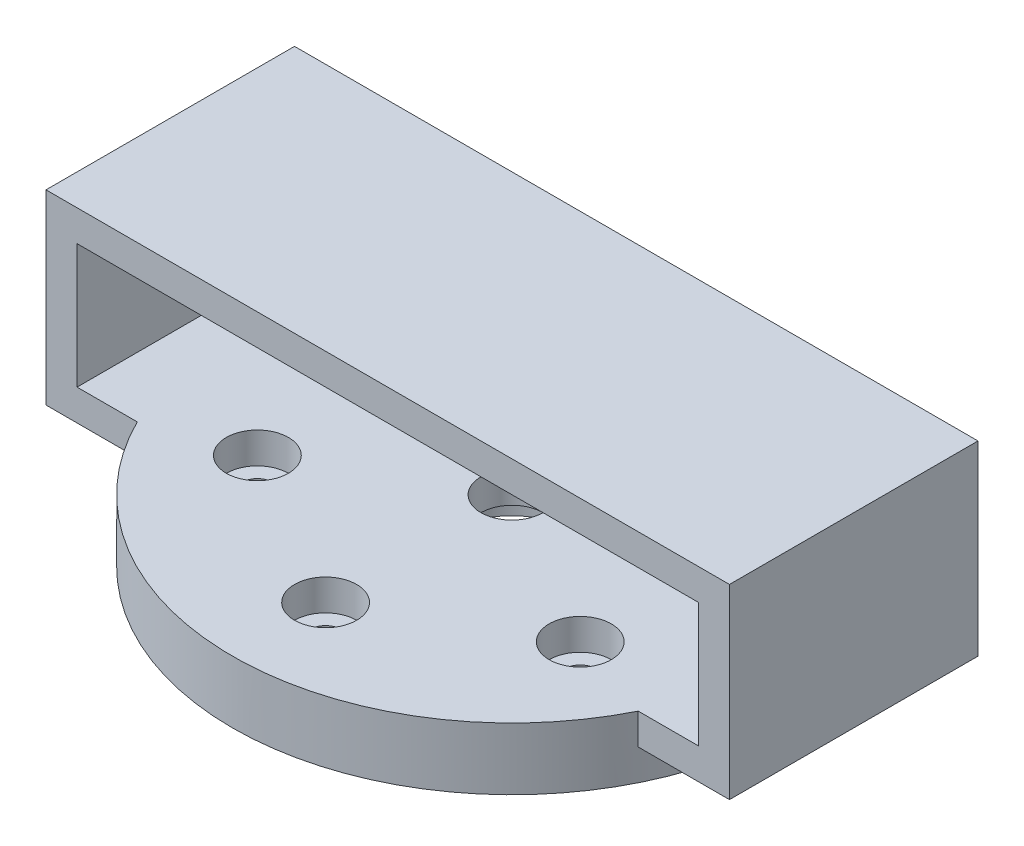
ISO-10303-21;
HEADER;
FILE_DESCRIPTION(('STEP AP214'),'2;1');
FILE_NAME('part.step','',(''),(''),'','','');
FILE_SCHEMA(('AUTOMOTIVE_DESIGN { 1 0 10303 214 1 1 1 1 }'));
ENDSEC;
DATA;
#1=APPLICATION_CONTEXT('core data for automotive mechanical design processes');
#2=APPLICATION_PROTOCOL_DEFINITION('international standard','automotive_design',2000,#1);
#3=PRODUCT_CONTEXT('',#1,'mechanical');
#4=PRODUCT('Part','Part','',(#3));
#5=PRODUCT_RELATED_PRODUCT_CATEGORY('part','',(#4));
#6=PRODUCT_DEFINITION_FORMATION('','',#4);
#7=PRODUCT_DEFINITION_CONTEXT('part definition',#1,'design');
#8=PRODUCT_DEFINITION('design','',#6,#7);
#9=PRODUCT_DEFINITION_SHAPE('','',#8);
#10=(LENGTH_UNIT() NAMED_UNIT(*) SI_UNIT(.MILLI.,.METRE.));
#11=(NAMED_UNIT(*) PLANE_ANGLE_UNIT() SI_UNIT($,.RADIAN.));
#12=(NAMED_UNIT(*) SI_UNIT($,.STERADIAN.) SOLID_ANGLE_UNIT());
#13=UNCERTAINTY_MEASURE_WITH_UNIT(LENGTH_MEASURE(1.E-05),#10,'distance_accuracy_value','');
#14=(GEOMETRIC_REPRESENTATION_CONTEXT(3) GLOBAL_UNCERTAINTY_ASSIGNED_CONTEXT((#13)) GLOBAL_UNIT_ASSIGNED_CONTEXT((#10,
#11,#12)) REPRESENTATION_CONTEXT('',''));
#15=CARTESIAN_POINT('',(0.,0.,0.));
#16=DIRECTION('',(0.,0.,1.));
#17=DIRECTION('',(1.,0.,0.));
#18=AXIS2_PLACEMENT_3D('',#15,#16,#17);
#19=CARTESIAN_POINT('',(0.,10.,-30.));
#20=DIRECTION('',(0.,-1.,0.));
#21=DIRECTION('',(0.,0.,-1.));
#22=AXIS2_PLACEMENT_3D('',#19,#20,#21);
#23=CYLINDRICAL_SURFACE('',#22,2.5);
#24=CARTESIAN_POINT('',(0.,0.,-30.));
#25=DIRECTION('',(0.,1.,0.));
#26=DIRECTION('',(0.,0.,1.));
#27=AXIS2_PLACEMENT_3D('',#24,#25,#26);
#28=CIRCLE('',#27,2.5);
#29=CARTESIAN_POINT('',(0.,0.,-27.5));
#30=VERTEX_POINT('',#29);
#31=EDGE_CURVE('E225',#30,#30,#28,.T.);
#32=ORIENTED_EDGE('',*,*,#31,.F.);
#33=EDGE_LOOP('',(#32));
#34=FACE_BOUND('',#33,.T.);
#35=CARTESIAN_POINT('',(0.,5.,-30.));
#36=DIRECTION('',(0.,1.,0.));
#37=DIRECTION('',(0.,0.,1.));
#38=AXIS2_PLACEMENT_3D('',#35,#36,#37);
#39=CIRCLE('',#38,2.5);
#40=CARTESIAN_POINT('',(0.,5.,-27.5));
#41=VERTEX_POINT('',#40);
#42=EDGE_CURVE('E39',#41,#41,#39,.T.);
#43=ORIENTED_EDGE('',*,*,#42,.T.);
#44=EDGE_LOOP('',(#43));
#45=FACE_BOUND('',#44,.T.);
#46=ADVANCED_FACE('F35',(#34,#45),#23,.F.);
#47=CARTESIAN_POINT('',(3.39958331045615E-12,10.,30.));
#48=DIRECTION('',(0.,-1.,0.));
#49=DIRECTION('',(0.,0.,-1.));
#50=AXIS2_PLACEMENT_3D('',#47,#48,#49);
#51=CYLINDRICAL_SURFACE('',#50,2.50000000000345);
#52=CARTESIAN_POINT('',(3.39958331045615E-12,0.,30.));
#53=DIRECTION('',(0.,1.,0.));
#54=DIRECTION('',(0.,0.,1.));
#55=AXIS2_PLACEMENT_3D('',#52,#53,#54);
#56=CIRCLE('',#55,2.50000000000345);
#57=CARTESIAN_POINT('',(3.39958331045615E-12,0.,32.5000000000035));
#58=VERTEX_POINT('',#57);
#59=EDGE_CURVE('E216',#58,#58,#56,.T.);
#60=ORIENTED_EDGE('',*,*,#59,.F.);
#61=EDGE_LOOP('',(#60));
#62=FACE_BOUND('',#61,.T.);
#63=CARTESIAN_POINT('',(3.39958331045615E-12,5.,30.));
#64=DIRECTION('',(0.,1.,0.));
#65=DIRECTION('',(0.,0.,1.));
#66=AXIS2_PLACEMENT_3D('',#63,#64,#65);
#67=CIRCLE('',#66,2.50000000000345);
#68=CARTESIAN_POINT('',(3.39958331045615E-12,5.,32.5000000000035));
#69=VERTEX_POINT('',#68);
#70=EDGE_CURVE('E251',#69,#69,#67,.T.);
#71=ORIENTED_EDGE('',*,*,#70,.T.);
#72=EDGE_LOOP('',(#71));
#73=FACE_BOUND('',#72,.T.);
#74=ADVANCED_FACE('F320',(#62,#73),#51,.F.);
#75=CARTESIAN_POINT('',(0.,10.,0.));
#76=DIRECTION('',(0.,-1.,0.));
#77=DIRECTION('',(0.,0.,-1.));
#78=AXIS2_PLACEMENT_3D('',#75,#76,#77);
#79=CYLINDRICAL_SURFACE('',#78,10.);
#80=CARTESIAN_POINT('',(0.,0.,0.));
#81=DIRECTION('',(0.,1.,0.));
#82=DIRECTION('',(0.,0.,1.));
#83=AXIS2_PLACEMENT_3D('',#80,#81,#82);
#84=CIRCLE('',#83,10.);
#85=CARTESIAN_POINT('',(0.,0.,10.));
#86=VERTEX_POINT('',#85);
#87=EDGE_CURVE('E228',#86,#86,#84,.T.);
#88=ORIENTED_EDGE('',*,*,#87,.F.);
#89=EDGE_LOOP('',(#88));
#90=FACE_BOUND('',#89,.T.);
#91=CARTESIAN_POINT('',(0.,5.,0.));
#92=DIRECTION('',(0.,1.,0.));
#93=DIRECTION('',(0.,0.,1.));
#94=AXIS2_PLACEMENT_3D('',#91,#92,#93);
#95=CIRCLE('',#94,10.);
#96=CARTESIAN_POINT('',(0.,5.,10.));
#97=VERTEX_POINT('',#96);
#98=EDGE_CURVE('E190',#97,#97,#95,.T.);
#99=ORIENTED_EDGE('',*,*,#98,.T.);
#100=EDGE_LOOP('',(#99));
#101=FACE_BOUND('',#100,.T.);
#102=ADVANCED_FACE('F326',(#90,#101),#79,.F.);
#103=CARTESIAN_POINT('',(25.980762113534,10.,-15.0000000000015));
#104=DIRECTION('',(0.,-1.,0.));
#105=DIRECTION('',(0.,0.,-1.));
#106=AXIS2_PLACEMENT_3D('',#103,#104,#105);
#107=CYLINDRICAL_SURFACE('',#106,2.50000000000046);
#108=CARTESIAN_POINT('',(25.980762113534,0.,-15.0000000000015));
#109=DIRECTION('',(0.,1.,0.));
#110=DIRECTION('',(0.,0.,1.));
#111=AXIS2_PLACEMENT_3D('',#108,#109,#110);
#112=CIRCLE('',#111,2.50000000000046);
#113=CARTESIAN_POINT('',(25.980762113534,0.,-12.500000000001));
#114=VERTEX_POINT('',#113);
#115=EDGE_CURVE('E222',#114,#114,#112,.T.);
#116=ORIENTED_EDGE('',*,*,#115,.F.);
#117=EDGE_LOOP('',(#116));
#118=FACE_BOUND('',#117,.T.);
#119=CARTESIAN_POINT('',(25.980762113534,5.,-15.0000000000015));
#120=DIRECTION('',(0.,1.,0.));
#121=DIRECTION('',(0.,0.,1.));
#122=AXIS2_PLACEMENT_3D('',#119,#120,#121);
#123=CIRCLE('',#122,2.50000000000046);
#124=CARTESIAN_POINT('',(25.980762113534,5.,-12.500000000001));
#125=VERTEX_POINT('',#124);
#126=EDGE_CURVE('E202',#125,#125,#123,.T.);
#127=ORIENTED_EDGE('',*,*,#126,.T.);
#128=EDGE_LOOP('',(#127));
#129=FACE_BOUND('',#128,.T.);
#130=ADVANCED_FACE('F332',(#118,#129),#107,.F.);
#131=CARTESIAN_POINT('',(25.9807621135357,10.,14.9999999999985));
#132=DIRECTION('',(0.,-1.,0.));
#133=DIRECTION('',(0.,0.,-1.));
#134=AXIS2_PLACEMENT_3D('',#131,#132,#133);
#135=CYLINDRICAL_SURFACE('',#134,2.50000000000215);
#136=CARTESIAN_POINT('',(25.9807621135357,0.,14.9999999999985));
#137=DIRECTION('',(0.,1.,0.));
#138=DIRECTION('',(0.,0.,1.));
#139=AXIS2_PLACEMENT_3D('',#136,#137,#138);
#140=CIRCLE('',#139,2.50000000000215);
#141=CARTESIAN_POINT('',(25.9807621135357,0.,17.5000000000007));
#142=VERTEX_POINT('',#141);
#143=EDGE_CURVE('E219',#142,#142,#140,.T.);
#144=ORIENTED_EDGE('',*,*,#143,.F.);
#145=EDGE_LOOP('',(#144));
#146=FACE_BOUND('',#145,.T.);
#147=CARTESIAN_POINT('',(25.9807621135357,5.,14.9999999999985));
#148=DIRECTION('',(0.,1.,0.));
#149=DIRECTION('',(0.,0.,1.));
#150=AXIS2_PLACEMENT_3D('',#147,#148,#149);
#151=CIRCLE('',#150,2.50000000000215);
#152=CARTESIAN_POINT('',(25.9807621135357,5.,17.5000000000007));
#153=VERTEX_POINT('',#152);
#154=EDGE_CURVE('E199',#153,#153,#151,.T.);
#155=ORIENTED_EDGE('',*,*,#154,.T.);
#156=EDGE_LOOP('',(#155));
#157=FACE_BOUND('',#156,.T.);
#158=ADVANCED_FACE('F339',(#146,#157),#135,.F.);
#159=CARTESIAN_POINT('',(-25.9807621135306,10.,15.0000000000015));
#160=DIRECTION('',(0.,-1.,0.));
#161=DIRECTION('',(0.,0.,-1.));
#162=AXIS2_PLACEMENT_3D('',#159,#160,#161);
#163=CYLINDRICAL_SURFACE('',#162,2.50000000000315);
#164=CARTESIAN_POINT('',(-25.9807621135306,0.,15.0000000000015));
#165=DIRECTION('',(0.,1.,0.));
#166=DIRECTION('',(0.,0.,1.));
#167=AXIS2_PLACEMENT_3D('',#164,#165,#166);
#168=CIRCLE('',#167,2.50000000000315);
#169=CARTESIAN_POINT('',(-25.9807621135306,0.,17.5000000000046));
#170=VERTEX_POINT('',#169);
#171=EDGE_CURVE('E213',#170,#170,#168,.T.);
#172=ORIENTED_EDGE('',*,*,#171,.F.);
#173=EDGE_LOOP('',(#172));
#174=FACE_BOUND('',#173,.T.);
#175=CARTESIAN_POINT('',(-25.9807621135306,5.,15.0000000000015));
#176=DIRECTION('',(0.,1.,0.));
#177=DIRECTION('',(0.,0.,1.));
#178=AXIS2_PLACEMENT_3D('',#175,#176,#177);
#179=CIRCLE('',#178,2.50000000000315);
#180=CARTESIAN_POINT('',(-25.9807621135306,5.,17.5000000000046));
#181=VERTEX_POINT('',#180);
#182=EDGE_CURVE('E196',#181,#181,#179,.T.);
#183=ORIENTED_EDGE('',*,*,#182,.T.);
#184=EDGE_LOOP('',(#183));
#185=FACE_BOUND('',#184,.T.);
#186=ADVANCED_FACE('F313',(#174,#185),#163,.F.);
#187=CARTESIAN_POINT('',(-25.9807621135323,10.,-14.9999999999985));
#188=DIRECTION('',(0.,-1.,0.));
#189=DIRECTION('',(0.,0.,-1.));
#190=AXIS2_PLACEMENT_3D('',#187,#188,#189);
#191=CYLINDRICAL_SURFACE('',#190,2.5000000000016);
#192=CARTESIAN_POINT('',(-25.9807621135323,0.,-14.9999999999985));
#193=DIRECTION('',(0.,1.,0.));
#194=DIRECTION('',(0.,0.,1.));
#195=AXIS2_PLACEMENT_3D('',#192,#193,#194);
#196=CIRCLE('',#195,2.5000000000016);
#197=CARTESIAN_POINT('',(-25.9807621135323,0.,-12.4999999999969));
#198=VERTEX_POINT('',#197);
#199=EDGE_CURVE('E210',#198,#198,#196,.T.);
#200=ORIENTED_EDGE('',*,*,#199,.F.);
#201=EDGE_LOOP('',(#200));
#202=FACE_BOUND('',#201,.T.);
#203=CARTESIAN_POINT('',(-25.9807621135323,5.,-14.9999999999985));
#204=DIRECTION('',(0.,1.,0.));
#205=DIRECTION('',(0.,0.,1.));
#206=AXIS2_PLACEMENT_3D('',#203,#204,#205);
#207=CIRCLE('',#206,2.5000000000016);
#208=CARTESIAN_POINT('',(-25.9807621135323,5.,-12.4999999999969));
#209=VERTEX_POINT('',#208);
#210=EDGE_CURVE('E146',#209,#209,#207,.T.);
#211=ORIENTED_EDGE('',*,*,#210,.T.);
#212=EDGE_LOOP('',(#211));
#213=FACE_BOUND('',#212,.T.);
#214=ADVANCED_FACE('F305',(#202,#213),#191,.F.);
#215=CARTESIAN_POINT('',(0.,10.,0.));
#216=DIRECTION('',(0.,1.,0.));
#217=DIRECTION('',(0.,0.,1.));
#218=AXIS2_PLACEMENT_3D('',#215,#216,#217);
#219=PLANE('',#218);
#220=CARTESIAN_POINT('',(0.,10.,-30.));
#221=DIRECTION('',(0.,1.,0.));
#222=DIRECTION('',(0.,0.,1.));
#223=AXIS2_PLACEMENT_3D('',#220,#221,#222);
#224=CIRCLE('',#223,5.);
#225=CARTESIAN_POINT('',(0.,10.,-25.));
#226=VERTEX_POINT('',#225);
#227=EDGE_CURVE('E258',#226,#226,#224,.T.);
#228=ORIENTED_EDGE('',*,*,#227,.F.);
#229=EDGE_LOOP('',(#228));
#230=FACE_BOUND('',#229,.T.);
#231=CARTESIAN_POINT('',(1.69794191727524E-12,10.,0.));
#232=DIRECTION('',(0.,1.,0.));
#233=DIRECTION('',(0.,0.,1.));
#234=AXIS2_PLACEMENT_3D('',#231,#232,#233);
#235=CIRCLE('',#234,5.);
#236=CARTESIAN_POINT('',(1.69794191727524E-12,10.,5.));
#237=VERTEX_POINT('',#236);
#238=EDGE_CURVE('E268',#237,#237,#235,.T.);
#239=ORIENTED_EDGE('',*,*,#238,.F.);
#240=EDGE_LOOP('',(#239));
#241=FACE_BOUND('',#240,.T.);
#242=CARTESIAN_POINT('',(25.980762113534,10.,-15.0000000000015));
#243=DIRECTION('',(0.,1.,0.));
#244=DIRECTION('',(0.,0.,1.));
#245=AXIS2_PLACEMENT_3D('',#242,#243,#244);
#246=CIRCLE('',#245,5.00000000000046);
#247=CARTESIAN_POINT('',(25.980762113534,10.,-10.000000000001));
#248=VERTEX_POINT('',#247);
#249=EDGE_CURVE('E274',#248,#248,#246,.T.);
#250=ORIENTED_EDGE('',*,*,#249,.F.);
#251=EDGE_LOOP('',(#250));
#252=FACE_BOUND('',#251,.T.);
#253=CARTESIAN_POINT('',(25.9807621135357,10.,14.9999999999985));
#254=DIRECTION('',(0.,1.,0.));
#255=DIRECTION('',(0.,0.,1.));
#256=AXIS2_PLACEMENT_3D('',#253,#254,#255);
#257=CIRCLE('',#256,5.00000000000214);
#258=CARTESIAN_POINT('',(25.9807621135357,10.,20.0000000000007));
#259=VERTEX_POINT('',#258);
#260=EDGE_CURVE('E280',#259,#259,#257,.T.);
#261=ORIENTED_EDGE('',*,*,#260,.F.);
#262=EDGE_LOOP('',(#261));
#263=FACE_BOUND('',#262,.T.);
#264=CARTESIAN_POINT('',(3.39958331045615E-12,10.,30.));
#265=DIRECTION('',(0.,1.,0.));
#266=DIRECTION('',(0.,0.,1.));
#267=AXIS2_PLACEMENT_3D('',#264,#265,#266);
#268=CIRCLE('',#267,5.00000000000345);
#269=CARTESIAN_POINT('',(3.39958331045615E-12,10.,35.0000000000034));
#270=VERTEX_POINT('',#269);
#271=EDGE_CURVE('E286',#270,#270,#268,.T.);
#272=ORIENTED_EDGE('',*,*,#271,.F.);
#273=EDGE_LOOP('',(#272));
#274=FACE_BOUND('',#273,.T.);
#275=CARTESIAN_POINT('',(-25.9807621135306,10.,15.0000000000015));
#276=DIRECTION('',(0.,1.,0.));
#277=DIRECTION('',(0.,0.,1.));
#278=AXIS2_PLACEMENT_3D('',#275,#276,#277);
#279=CIRCLE('',#278,5.00000000000315);
#280=CARTESIAN_POINT('',(-25.9807621135306,10.,20.0000000000046));
#281=VERTEX_POINT('',#280);
#282=EDGE_CURVE('E292',#281,#281,#279,.T.);
#283=ORIENTED_EDGE('',*,*,#282,.F.);
#284=EDGE_LOOP('',(#283));
#285=FACE_BOUND('',#284,.T.);
#286=CARTESIAN_POINT('',(-25.9807621135323,10.,-14.9999999999985));
#287=DIRECTION('',(0.,1.,0.));
#288=DIRECTION('',(0.,0.,1.));
#289=AXIS2_PLACEMENT_3D('',#286,#287,#288);
#290=CIRCLE('',#289,5.0000000000016);
#291=CARTESIAN_POINT('',(-25.9807621135323,10.,-9.99999999999691));
#292=VERTEX_POINT('',#291);
#293=EDGE_CURVE('E297',#292,#292,#290,.T.);
#294=ORIENTED_EDGE('',*,*,#293,.F.);
#295=EDGE_LOOP('',(#294));
#296=FACE_BOUND('',#295,.T.);
#297=CARTESIAN_POINT('',(0.,10.,0.));
#298=DIRECTION('',(0.,1.,0.));
#299=DIRECTION('',(0.,0.,1.));
#300=AXIS2_PLACEMENT_3D('',#297,#298,#299);
#301=CIRCLE('',#300,45.);
#302=CARTESIAN_POINT('',(-40.3112887414927,10.,20.));
#303=VERTEX_POINT('',#302);
#304=CARTESIAN_POINT('',(40.3112887414927,10.,20.));
#305=VERTEX_POINT('',#304);
#306=EDGE_CURVE('E232',#303,#305,#301,.T.);
#307=ORIENTED_EDGE('',*,*,#306,.T.);
#308=DIRECTION('',(1.,0.,0.));
#309=VECTOR('',#308,1.);
#310=CARTESIAN_POINT('',(-55.,10.,20.));
#311=LINE('',#310,#309);
#312=CARTESIAN_POINT('',(50.,10.,20.));
#313=VERTEX_POINT('',#312);
#314=EDGE_CURVE('E46',#305,#313,#311,.T.);
#315=ORIENTED_EDGE('',*,*,#314,.T.);
#316=DIRECTION('',(0.,0.,-1.));
#317=VECTOR('',#316,1.);
#318=CARTESIAN_POINT('',(50.,10.,25.));
#319=LINE('',#318,#317);
#320=CARTESIAN_POINT('',(50.,10.,-20.));
#321=VERTEX_POINT('',#320);
#322=EDGE_CURVE('E125',#313,#321,#319,.T.);
#323=ORIENTED_EDGE('',*,*,#322,.T.);
#324=DIRECTION('',(-1.,0.,0.));
#325=VECTOR('',#324,1.);
#326=CARTESIAN_POINT('',(50.,10.,-20.));
#327=LINE('',#326,#325);
#328=CARTESIAN_POINT('',(40.3112887414927,10.,-20.));
#329=VERTEX_POINT('',#328);
#330=EDGE_CURVE('E130',#321,#329,#327,.T.);
#331=ORIENTED_EDGE('',*,*,#330,.T.);
#332=CARTESIAN_POINT('',(-40.3112887414927,10.,-20.));
#333=VERTEX_POINT('',#332);
#334=EDGE_CURVE('E234',#329,#333,#301,.T.);
#335=ORIENTED_EDGE('',*,*,#334,.T.);
#336=CARTESIAN_POINT('',(-50.,10.,-20.));
#337=VERTEX_POINT('',#336);
#338=EDGE_CURVE('E145',#333,#337,#327,.T.);
#339=ORIENTED_EDGE('',*,*,#338,.T.);
#340=DIRECTION('',(0.,0.,-1.));
#341=VECTOR('',#340,1.);
#342=CARTESIAN_POINT('',(-50.,10.,25.));
#343=LINE('',#342,#341);
#344=CARTESIAN_POINT('',(-50.,10.,20.));
#345=VERTEX_POINT('',#344);
#346=EDGE_CURVE('E134',#345,#337,#343,.T.);
#347=ORIENTED_EDGE('',*,*,#346,.F.);
#348=EDGE_CURVE('E11',#345,#303,#311,.T.);
#349=ORIENTED_EDGE('',*,*,#348,.T.);
#350=EDGE_LOOP('',(#307,#315,#323,#331,#335,#339,#347,#349));
#351=FACE_BOUND('',#350,.T.);
#352=ADVANCED_FACE('F127',(#230,#241,#252,#263,#274,#285,#296,#351),#219,.T.);
#353=CARTESIAN_POINT('',(0.,0.,0.));
#354=DIRECTION('',(0.,1.,0.));
#355=DIRECTION('',(0.,0.,1.));
#356=AXIS2_PLACEMENT_3D('',#353,#354,#355);
#357=PLANE('',#356);
#358=CARTESIAN_POINT('',(0.,0.,0.));
#359=DIRECTION('',(0.,1.,0.));
#360=DIRECTION('',(0.,0.,1.));
#361=AXIS2_PLACEMENT_3D('',#358,#359,#360);
#362=CIRCLE('',#361,45.);
#363=CARTESIAN_POINT('',(0.,0.,45.));
#364=VERTEX_POINT('',#363);
#365=EDGE_CURVE('E231',#364,#364,#362,.T.);
#366=ORIENTED_EDGE('',*,*,#365,.F.);
#367=EDGE_LOOP('',(#366));
#368=FACE_BOUND('',#367,.T.);
#369=ORIENTED_EDGE('',*,*,#87,.T.);
#370=EDGE_LOOP('',(#369));
#371=FACE_BOUND('',#370,.T.);
#372=ORIENTED_EDGE('',*,*,#31,.T.);
#373=EDGE_LOOP('',(#372));
#374=FACE_BOUND('',#373,.T.);
#375=ORIENTED_EDGE('',*,*,#115,.T.);
#376=EDGE_LOOP('',(#375));
#377=FACE_BOUND('',#376,.T.);
#378=ORIENTED_EDGE('',*,*,#143,.T.);
#379=EDGE_LOOP('',(#378));
#380=FACE_BOUND('',#379,.T.);
#381=ORIENTED_EDGE('',*,*,#59,.T.);
#382=EDGE_LOOP('',(#381));
#383=FACE_BOUND('',#382,.T.);
#384=ORIENTED_EDGE('',*,*,#171,.T.);
#385=EDGE_LOOP('',(#384));
#386=FACE_BOUND('',#385,.T.);
#387=ORIENTED_EDGE('',*,*,#199,.T.);
#388=EDGE_LOOP('',(#387));
#389=FACE_BOUND('',#388,.T.);
#390=ADVANCED_FACE('F304',(#368,#371,#374,#377,#380,#383,#386,#389),#357,.F.);
#391=CARTESIAN_POINT('',(0.,10.,0.));
#392=DIRECTION('',(0.,-1.,0.));
#393=DIRECTION('',(0.,0.,-1.));
#394=AXIS2_PLACEMENT_3D('',#391,#392,#393);
#395=CYLINDRICAL_SURFACE('',#394,45.);
#396=ORIENTED_EDGE('',*,*,#334,.F.);
#397=DIRECTION('',(0.,-1.,0.));
#398=VECTOR('',#397,1.);
#399=CARTESIAN_POINT('',(40.3112887414927,10.,-20.));
#400=LINE('',#399,#398);
#401=CARTESIAN_POINT('',(40.3112887414927,5.,-20.));
#402=VERTEX_POINT('',#401);
#403=EDGE_CURVE('E53',#329,#402,#400,.T.);
#404=ORIENTED_EDGE('',*,*,#403,.T.);
#405=CARTESIAN_POINT('',(0.,5.,0.));
#406=DIRECTION('',(0.,1.,0.));
#407=DIRECTION('',(0.,0.,1.));
#408=AXIS2_PLACEMENT_3D('',#405,#406,#407);
#409=CIRCLE('',#408,45.);
#410=CARTESIAN_POINT('',(40.3112887414927,5.,20.));
#411=VERTEX_POINT('',#410);
#412=EDGE_CURVE('E57',#411,#402,#409,.T.);
#413=ORIENTED_EDGE('',*,*,#412,.F.);
#414=DIRECTION('',(0.,-1.,0.));
#415=VECTOR('',#414,1.);
#416=CARTESIAN_POINT('',(40.3112887414927,10.,20.));
#417=LINE('',#416,#415);
#418=EDGE_CURVE('E244',#411,#305,#417,.F.);
#419=ORIENTED_EDGE('',*,*,#418,.T.);
#420=ORIENTED_EDGE('',*,*,#306,.F.);
#421=DIRECTION('',(0.,-1.,0.));
#422=VECTOR('',#421,1.);
#423=CARTESIAN_POINT('',(-40.3112887414927,10.,20.));
#424=LINE('',#423,#422);
#425=CARTESIAN_POINT('',(-40.3112887414927,5.,20.));
#426=VERTEX_POINT('',#425);
#427=EDGE_CURVE('E239',#303,#426,#424,.T.);
#428=ORIENTED_EDGE('',*,*,#427,.T.);
#429=CARTESIAN_POINT('',(-40.3112887414927,5.,-20.));
#430=VERTEX_POINT('',#429);
#431=EDGE_CURVE('E207',#430,#426,#409,.T.);
#432=ORIENTED_EDGE('',*,*,#431,.F.);
#433=DIRECTION('',(0.,-1.,0.));
#434=VECTOR('',#433,1.);
#435=CARTESIAN_POINT('',(-40.3112887414927,10.,-20.));
#436=LINE('',#435,#434);
#437=EDGE_CURVE('E241',#430,#333,#436,.F.);
#438=ORIENTED_EDGE('',*,*,#437,.T.);
#439=EDGE_LOOP('',(#396,#404,#413,#419,#420,#428,#432,#438));
#440=FACE_BOUND('',#439,.T.);
#441=ORIENTED_EDGE('',*,*,#365,.T.);
#442=EDGE_LOOP('',(#441));
#443=FACE_BOUND('',#442,.T.);
#444=ADVANCED_FACE('F37',(#440,#443),#395,.T.);
#445=CARTESIAN_POINT('',(0.,5.,0.));
#446=DIRECTION('',(0.,1.,0.));
#447=DIRECTION('',(0.,0.,1.));
#448=AXIS2_PLACEMENT_3D('',#445,#446,#447);
#449=PLANE('',#448);
#450=CARTESIAN_POINT('',(1.69794191727524E-12,5.,0.));
#451=DIRECTION('',(0.,1.,0.));
#452=DIRECTION('',(0.,0.,1.));
#453=AXIS2_PLACEMENT_3D('',#450,#451,#452);
#454=CIRCLE('',#453,5.);
#455=CARTESIAN_POINT('',(1.69794191727524E-12,5.,5.));
#456=VERTEX_POINT('',#455);
#457=EDGE_CURVE('E263',#456,#456,#454,.T.);
#458=ORIENTED_EDGE('',*,*,#457,.T.);
#459=EDGE_LOOP('',(#458));
#460=FACE_BOUND('',#459,.T.);
#461=ORIENTED_EDGE('',*,*,#98,.F.);
#462=EDGE_LOOP('',(#461));
#463=FACE_BOUND('',#462,.T.);
#464=ADVANCED_FACE('F345',(#460,#463),#449,.F.);
#465=CARTESIAN_POINT('',(-55.,5.,-20.));
#466=DIRECTION('',(0.,0.,-1.));
#467=DIRECTION('',(-1.,0.,0.));
#468=AXIS2_PLACEMENT_3D('',#465,#466,#467);
#469=PLANE('',#468);
#470=ORIENTED_EDGE('',*,*,#330,.F.);
#471=DIRECTION('',(0.,-1.,0.));
#472=VECTOR('',#471,1.);
#473=CARTESIAN_POINT('',(50.,30.,-20.));
#474=LINE('',#473,#472);
#475=CARTESIAN_POINT('',(50.,30.,-20.));
#476=VERTEX_POINT('',#475);
#477=EDGE_CURVE('E138',#476,#321,#474,.T.);
#478=ORIENTED_EDGE('',*,*,#477,.F.);
#479=DIRECTION('',(1.,0.,0.));
#480=VECTOR('',#479,1.);
#481=CARTESIAN_POINT('',(50.,30.,-20.));
#482=LINE('',#481,#480);
#483=CARTESIAN_POINT('',(-50.,30.,-20.));
#484=VERTEX_POINT('',#483);
#485=EDGE_CURVE('E135',#484,#476,#482,.T.);
#486=ORIENTED_EDGE('',*,*,#485,.F.);
#487=DIRECTION('',(0.,1.,0.));
#488=VECTOR('',#487,1.);
#489=CARTESIAN_POINT('',(-50.,30.,-20.));
#490=LINE('',#489,#488);
#491=EDGE_CURVE('E150',#337,#484,#490,.T.);
#492=ORIENTED_EDGE('',*,*,#491,.F.);
#493=ORIENTED_EDGE('',*,*,#338,.F.);
#494=ORIENTED_EDGE('',*,*,#437,.F.);
#495=DIRECTION('',(-1.,0.,0.));
#496=VECTOR('',#495,1.);
#497=CARTESIAN_POINT('',(-55.,5.,-20.));
#498=LINE('',#497,#496);
#499=CARTESIAN_POINT('',(-55.,5.,-20.));
#500=VERTEX_POINT('',#499);
#501=EDGE_CURVE('E184',#430,#500,#498,.T.);
#502=ORIENTED_EDGE('',*,*,#501,.T.);
#503=DIRECTION('',(0.,1.,0.));
#504=VECTOR('',#503,1.);
#505=CARTESIAN_POINT('',(-55.,5.,-20.));
#506=LINE('',#505,#504);
#507=CARTESIAN_POINT('',(-55.,35.,-20.));
#508=VERTEX_POINT('',#507);
#509=EDGE_CURVE('E188',#500,#508,#506,.T.);
#510=ORIENTED_EDGE('',*,*,#509,.T.);
#511=DIRECTION('',(-1.,0.,0.));
#512=VECTOR('',#511,1.);
#513=CARTESIAN_POINT('',(-55.,35.,-20.));
#514=LINE('',#513,#512);
#515=CARTESIAN_POINT('',(55.,35.,-20.));
#516=VERTEX_POINT('',#515);
#517=EDGE_CURVE('E171',#516,#508,#514,.T.);
#518=ORIENTED_EDGE('',*,*,#517,.F.);
#519=DIRECTION('',(0.,1.,0.));
#520=VECTOR('',#519,1.);
#521=CARTESIAN_POINT('',(55.,5.,-20.));
#522=LINE('',#521,#520);
#523=CARTESIAN_POINT('',(55.,5.,-20.));
#524=VERTEX_POINT('',#523);
#525=EDGE_CURVE('E191',#524,#516,#522,.T.);
#526=ORIENTED_EDGE('',*,*,#525,.F.);
#527=EDGE_CURVE('E185',#524,#402,#498,.T.);
#528=ORIENTED_EDGE('',*,*,#527,.T.);
#529=ORIENTED_EDGE('',*,*,#403,.F.);
#530=EDGE_LOOP('',(#470,#478,#486,#492,#493,#494,#502,#510,#518,#526,#528,#529));
#531=FACE_BOUND('',#530,.T.);
#532=ADVANCED_FACE('F148',(#531),#469,.T.);
#533=CARTESIAN_POINT('',(-55.,5.,20.));
#534=DIRECTION('',(0.,0.,1.));
#535=DIRECTION('',(1.,0.,0.));
#536=AXIS2_PLACEMENT_3D('',#533,#534,#535);
#537=PLANE('',#536);
#538=ORIENTED_EDGE('',*,*,#348,.F.);
#539=DIRECTION('',(0.,-1.,0.));
#540=VECTOR('',#539,1.);
#541=CARTESIAN_POINT('',(-50.,5.,20.));
#542=LINE('',#541,#540);
#543=CARTESIAN_POINT('',(-50.,30.,20.));
#544=VERTEX_POINT('',#543);
#545=EDGE_CURVE('E44',#544,#345,#542,.T.);
#546=ORIENTED_EDGE('',*,*,#545,.F.);
#547=DIRECTION('',(-1.,0.,0.));
#548=VECTOR('',#547,1.);
#549=CARTESIAN_POINT('',(-55.,30.,20.));
#550=LINE('',#549,#548);
#551=CARTESIAN_POINT('',(50.,30.,20.));
#552=VERTEX_POINT('',#551);
#553=EDGE_CURVE('E249',#552,#544,#550,.T.);
#554=ORIENTED_EDGE('',*,*,#553,.F.);
#555=DIRECTION('',(0.,1.,0.));
#556=VECTOR('',#555,1.);
#557=CARTESIAN_POINT('',(50.,5.,20.));
#558=LINE('',#557,#556);
#559=EDGE_CURVE('E247',#313,#552,#558,.T.);
#560=ORIENTED_EDGE('',*,*,#559,.F.);
#561=ORIENTED_EDGE('',*,*,#314,.F.);
#562=ORIENTED_EDGE('',*,*,#418,.F.);
#563=DIRECTION('',(1.,0.,0.));
#564=VECTOR('',#563,1.);
#565=CARTESIAN_POINT('',(-55.,5.,20.));
#566=LINE('',#565,#564);
#567=CARTESIAN_POINT('',(55.,5.,20.));
#568=VERTEX_POINT('',#567);
#569=EDGE_CURVE('E177',#411,#568,#566,.T.);
#570=ORIENTED_EDGE('',*,*,#569,.T.);
#571=DIRECTION('',(0.,1.,0.));
#572=VECTOR('',#571,1.);
#573=CARTESIAN_POINT('',(55.,5.,20.));
#574=LINE('',#573,#572);
#575=CARTESIAN_POINT('',(55.,35.,20.));
#576=VERTEX_POINT('',#575);
#577=EDGE_CURVE('E193',#568,#576,#574,.T.);
#578=ORIENTED_EDGE('',*,*,#577,.T.);
#579=DIRECTION('',(1.,0.,0.));
#580=VECTOR('',#579,1.);
#581=CARTESIAN_POINT('',(-55.,35.,20.));
#582=LINE('',#581,#580);
#583=CARTESIAN_POINT('',(-55.,35.,20.));
#584=VERTEX_POINT('',#583);
#585=EDGE_CURVE('E165',#584,#576,#582,.T.);
#586=ORIENTED_EDGE('',*,*,#585,.F.);
#587=DIRECTION('',(0.,1.,0.));
#588=VECTOR('',#587,1.);
#589=CARTESIAN_POINT('',(-55.,5.,20.));
#590=LINE('',#589,#588);
#591=CARTESIAN_POINT('',(-55.,5.,20.));
#592=VERTEX_POINT('',#591);
#593=EDGE_CURVE('E187',#592,#584,#590,.T.);
#594=ORIENTED_EDGE('',*,*,#593,.F.);
#595=EDGE_CURVE('E178',#592,#426,#566,.T.);
#596=ORIENTED_EDGE('',*,*,#595,.T.);
#597=ORIENTED_EDGE('',*,*,#427,.F.);
#598=EDGE_LOOP('',(#538,#546,#554,#560,#561,#562,#570,#578,#586,#594,#596,#597));
#599=FACE_BOUND('',#598,.T.);
#600=ADVANCED_FACE('F355',(#599),#537,.T.);
#601=ORIENTED_EDGE('',*,*,#569,.F.);
#602=ORIENTED_EDGE('',*,*,#412,.T.);
#603=ORIENTED_EDGE('',*,*,#527,.F.);
#604=DIRECTION('',(0.,0.,-1.));
#605=VECTOR('',#604,1.);
#606=CARTESIAN_POINT('',(55.,5.,-20.));
#607=LINE('',#606,#605);
#608=EDGE_CURVE('E181',#568,#524,#607,.T.);
#609=ORIENTED_EDGE('',*,*,#608,.F.);
#610=EDGE_LOOP('',(#601,#602,#603,#609));
#611=FACE_BOUND('',#610,.T.);
#612=ADVANCED_FACE('F350',(#611),#449,.F.);
#613=CARTESIAN_POINT('',(-55.,5.,-20.));
#614=DIRECTION('',(-1.,0.,0.));
#615=DIRECTION('',(0.,0.,1.));
#616=AXIS2_PLACEMENT_3D('',#613,#614,#615);
#617=PLANE('',#616);
#618=ORIENTED_EDGE('',*,*,#593,.T.);
#619=DIRECTION('',(0.,0.,1.));
#620=VECTOR('',#619,1.);
#621=CARTESIAN_POINT('',(-55.,35.,-20.));
#622=LINE('',#621,#620);
#623=EDGE_CURVE('E159',#508,#584,#622,.T.);
#624=ORIENTED_EDGE('',*,*,#623,.F.);
#625=ORIENTED_EDGE('',*,*,#509,.F.);
#626=DIRECTION('',(0.,0.,1.));
#627=VECTOR('',#626,1.);
#628=CARTESIAN_POINT('',(-55.,5.,-20.));
#629=LINE('',#628,#627);
#630=EDGE_CURVE('E174',#500,#592,#629,.T.);
#631=ORIENTED_EDGE('',*,*,#630,.T.);
#632=EDGE_LOOP('',(#618,#624,#625,#631));
#633=FACE_BOUND('',#632,.T.);
#634=ADVANCED_FACE('F363',(#633),#617,.T.);
#635=CARTESIAN_POINT('',(55.,5.,-20.));
#636=DIRECTION('',(1.,0.,0.));
#637=DIRECTION('',(0.,0.,-1.));
#638=AXIS2_PLACEMENT_3D('',#635,#636,#637);
#639=PLANE('',#638);
#640=ORIENTED_EDGE('',*,*,#525,.T.);
#641=DIRECTION('',(0.,0.,-1.));
#642=VECTOR('',#641,1.);
#643=CARTESIAN_POINT('',(55.,35.,-20.));
#644=LINE('',#643,#642);
#645=EDGE_CURVE('E168',#576,#516,#644,.T.);
#646=ORIENTED_EDGE('',*,*,#645,.F.);
#647=ORIENTED_EDGE('',*,*,#577,.F.);
#648=ORIENTED_EDGE('',*,*,#608,.T.);
#649=EDGE_LOOP('',(#640,#646,#647,#648));
#650=FACE_BOUND('',#649,.T.);
#651=ADVANCED_FACE('F360',(#650),#639,.T.);
#652=ORIENTED_EDGE('',*,*,#501,.F.);
#653=ORIENTED_EDGE('',*,*,#431,.T.);
#654=ORIENTED_EDGE('',*,*,#595,.F.);
#655=ORIENTED_EDGE('',*,*,#630,.F.);
#656=EDGE_LOOP('',(#652,#653,#654,#655));
#657=FACE_BOUND('',#656,.T.);
#658=ADVANCED_FACE('F349',(#657),#449,.F.);
#659=CARTESIAN_POINT('',(0.,35.,0.));
#660=DIRECTION('',(0.,1.,0.));
#661=DIRECTION('',(0.,0.,1.));
#662=AXIS2_PLACEMENT_3D('',#659,#660,#661);
#663=PLANE('',#662);
#664=ORIENTED_EDGE('',*,*,#623,.T.);
#665=ORIENTED_EDGE('',*,*,#585,.T.);
#666=ORIENTED_EDGE('',*,*,#645,.T.);
#667=ORIENTED_EDGE('',*,*,#517,.T.);
#668=EDGE_LOOP('',(#664,#665,#666,#667));
#669=FACE_BOUND('',#668,.T.);
#670=ADVANCED_FACE('F359',(#669),#663,.T.);
#671=CARTESIAN_POINT('',(50.,30.,25.));
#672=DIRECTION('',(1.,0.,0.));
#673=DIRECTION('',(0.,0.,-1.));
#674=AXIS2_PLACEMENT_3D('',#671,#672,#673);
#675=PLANE('',#674);
#676=ORIENTED_EDGE('',*,*,#559,.T.);
#677=DIRECTION('',(0.,0.,-1.));
#678=VECTOR('',#677,1.);
#679=CARTESIAN_POINT('',(50.,30.,25.));
#680=LINE('',#679,#678);
#681=EDGE_CURVE('E141',#552,#476,#680,.T.);
#682=ORIENTED_EDGE('',*,*,#681,.T.);
#683=ORIENTED_EDGE('',*,*,#477,.T.);
#684=ORIENTED_EDGE('',*,*,#322,.F.);
#685=EDGE_LOOP('',(#676,#682,#683,#684));
#686=FACE_BOUND('',#685,.T.);
#687=ADVANCED_FACE('F139',(#686),#675,.F.);
#688=CARTESIAN_POINT('',(50.,30.,25.));
#689=DIRECTION('',(0.,1.,0.));
#690=DIRECTION('',(0.,0.,1.));
#691=AXIS2_PLACEMENT_3D('',#688,#689,#690);
#692=PLANE('',#691);
#693=ORIENTED_EDGE('',*,*,#553,.T.);
#694=DIRECTION('',(0.,0.,-1.));
#695=VECTOR('',#694,1.);
#696=CARTESIAN_POINT('',(-50.,30.,25.));
#697=LINE('',#696,#695);
#698=EDGE_CURVE('E160',#544,#484,#697,.T.);
#699=ORIENTED_EDGE('',*,*,#698,.T.);
#700=ORIENTED_EDGE('',*,*,#485,.T.);
#701=ORIENTED_EDGE('',*,*,#681,.F.);
#702=EDGE_LOOP('',(#693,#699,#700,#701));
#703=FACE_BOUND('',#702,.T.);
#704=ADVANCED_FACE('F396',(#703),#692,.F.);
#705=CARTESIAN_POINT('',(-50.,30.,25.));
#706=DIRECTION('',(-1.,0.,0.));
#707=DIRECTION('',(0.,0.,1.));
#708=AXIS2_PLACEMENT_3D('',#705,#706,#707);
#709=PLANE('',#708);
#710=ORIENTED_EDGE('',*,*,#545,.T.);
#711=ORIENTED_EDGE('',*,*,#346,.T.);
#712=ORIENTED_EDGE('',*,*,#491,.T.);
#713=ORIENTED_EDGE('',*,*,#698,.F.);
#714=EDGE_LOOP('',(#710,#711,#712,#713));
#715=FACE_BOUND('',#714,.T.);
#716=ADVANCED_FACE('F400',(#715),#709,.F.);
#717=CARTESIAN_POINT('',(3.39958331045615E-12,5.,30.));
#718=DIRECTION('',(0.,1.,0.));
#719=DIRECTION('',(0.,0.,1.));
#720=AXIS2_PLACEMENT_3D('',#717,#718,#719);
#721=CYLINDRICAL_SURFACE('',#720,5.00000000000345);
#722=CARTESIAN_POINT('',(3.39958331045615E-12,5.,30.));
#723=DIRECTION('',(0.,1.,0.));
#724=DIRECTION('',(0.,0.,1.));
#725=AXIS2_PLACEMENT_3D('',#722,#723,#724);
#726=CIRCLE('',#725,5.00000000000345);
#727=CARTESIAN_POINT('',(3.39958331045615E-12,5.,35.0000000000034));
#728=VERTEX_POINT('',#727);
#729=EDGE_CURVE('E283',#728,#728,#726,.T.);
#730=ORIENTED_EDGE('',*,*,#729,.F.);
#731=EDGE_LOOP('',(#730));
#732=FACE_BOUND('',#731,.T.);
#733=ORIENTED_EDGE('',*,*,#271,.T.);
#734=EDGE_LOOP('',(#733));
#735=FACE_BOUND('',#734,.T.);
#736=ADVANCED_FACE('F402',(#732,#735),#721,.F.);
#737=CARTESIAN_POINT('',(3.39958331045615E-12,5.,30.));
#738=DIRECTION('',(0.,1.,0.));
#739=DIRECTION('',(0.,0.,1.));
#740=AXIS2_PLACEMENT_3D('',#737,#738,#739);
#741=PLANE('',#740);
#742=ORIENTED_EDGE('',*,*,#70,.F.);
#743=EDGE_LOOP('',(#742));
#744=FACE_BOUND('',#743,.T.);
#745=ORIENTED_EDGE('',*,*,#729,.T.);
#746=EDGE_LOOP('',(#745));
#747=FACE_BOUND('',#746,.T.);
#748=ADVANCED_FACE('F408',(#744,#747),#741,.T.);
#749=CARTESIAN_POINT('',(0.,5.,-30.));
#750=DIRECTION('',(0.,1.,0.));
#751=DIRECTION('',(0.,0.,1.));
#752=AXIS2_PLACEMENT_3D('',#749,#750,#751);
#753=CYLINDRICAL_SURFACE('',#752,5.);
#754=CARTESIAN_POINT('',(0.,5.,-30.));
#755=DIRECTION('',(0.,1.,0.));
#756=DIRECTION('',(0.,0.,1.));
#757=AXIS2_PLACEMENT_3D('',#754,#755,#756);
#758=CIRCLE('',#757,5.);
#759=CARTESIAN_POINT('',(0.,5.,-25.));
#760=VERTEX_POINT('',#759);
#761=EDGE_CURVE('E253',#760,#760,#758,.T.);
#762=ORIENTED_EDGE('',*,*,#761,.F.);
#763=EDGE_LOOP('',(#762));
#764=FACE_BOUND('',#763,.T.);
#765=ORIENTED_EDGE('',*,*,#227,.T.);
#766=EDGE_LOOP('',(#765));
#767=FACE_BOUND('',#766,.T.);
#768=ADVANCED_FACE('F471',(#764,#767),#753,.F.);
#769=CARTESIAN_POINT('',(0.,5.,-30.));
#770=DIRECTION('',(0.,1.,0.));
#771=DIRECTION('',(0.,0.,1.));
#772=AXIS2_PLACEMENT_3D('',#769,#770,#771);
#773=PLANE('',#772);
#774=ORIENTED_EDGE('',*,*,#42,.F.);
#775=EDGE_LOOP('',(#774));
#776=FACE_BOUND('',#775,.T.);
#777=ORIENTED_EDGE('',*,*,#761,.T.);
#778=EDGE_LOOP('',(#777));
#779=FACE_BOUND('',#778,.T.);
#780=ADVANCED_FACE('F481',(#776,#779),#773,.T.);
#781=CARTESIAN_POINT('',(-25.9807621135323,5.,-14.9999999999985));
#782=DIRECTION('',(0.,1.,0.));
#783=DIRECTION('',(0.,0.,1.));
#784=AXIS2_PLACEMENT_3D('',#781,#782,#783);
#785=CYLINDRICAL_SURFACE('',#784,5.0000000000016);
#786=CARTESIAN_POINT('',(-25.9807621135323,5.,-14.9999999999985));
#787=DIRECTION('',(0.,1.,0.));
#788=DIRECTION('',(0.,0.,1.));
#789=AXIS2_PLACEMENT_3D('',#786,#787,#788);
#790=CIRCLE('',#789,5.0000000000016);
#791=CARTESIAN_POINT('',(-25.9807621135323,5.,-9.99999999999691));
#792=VERTEX_POINT('',#791);
#793=EDGE_CURVE('E295',#792,#792,#790,.T.);
#794=ORIENTED_EDGE('',*,*,#793,.F.);
#795=EDGE_LOOP('',(#794));
#796=FACE_BOUND('',#795,.T.);
#797=ORIENTED_EDGE('',*,*,#293,.T.);
#798=EDGE_LOOP('',(#797));
#799=FACE_BOUND('',#798,.T.);
#800=ADVANCED_FACE('F301',(#796,#799),#785,.F.);
#801=CARTESIAN_POINT('',(-25.9807621135323,5.,-14.9999999999985));
#802=DIRECTION('',(0.,1.,0.));
#803=DIRECTION('',(0.,0.,1.));
#804=AXIS2_PLACEMENT_3D('',#801,#802,#803);
#805=PLANE('',#804);
#806=ORIENTED_EDGE('',*,*,#210,.F.);
#807=EDGE_LOOP('',(#806));
#808=FACE_BOUND('',#807,.T.);
#809=ORIENTED_EDGE('',*,*,#793,.T.);
#810=EDGE_LOOP('',(#809));
#811=FACE_BOUND('',#810,.T.);
#812=ADVANCED_FACE('F500',(#808,#811),#805,.T.);
#813=CARTESIAN_POINT('',(-25.9807621135306,5.,15.0000000000015));
#814=DIRECTION('',(0.,1.,0.));
#815=DIRECTION('',(0.,0.,1.));
#816=AXIS2_PLACEMENT_3D('',#813,#814,#815);
#817=CYLINDRICAL_SURFACE('',#816,5.00000000000315);
#818=CARTESIAN_POINT('',(-25.9807621135306,5.,15.0000000000015));
#819=DIRECTION('',(0.,1.,0.));
#820=DIRECTION('',(0.,0.,1.));
#821=AXIS2_PLACEMENT_3D('',#818,#819,#820);
#822=CIRCLE('',#821,5.00000000000315);
#823=CARTESIAN_POINT('',(-25.9807621135306,5.,20.0000000000046));
#824=VERTEX_POINT('',#823);
#825=EDGE_CURVE('E289',#824,#824,#822,.T.);
#826=ORIENTED_EDGE('',*,*,#825,.F.);
#827=EDGE_LOOP('',(#826));
#828=FACE_BOUND('',#827,.T.);
#829=ORIENTED_EDGE('',*,*,#282,.T.);
#830=EDGE_LOOP('',(#829));
#831=FACE_BOUND('',#830,.T.);
#832=ADVANCED_FACE('F509',(#828,#831),#817,.F.);
#833=CARTESIAN_POINT('',(-25.9807621135306,5.,15.0000000000015));
#834=DIRECTION('',(0.,1.,0.));
#835=DIRECTION('',(0.,0.,1.));
#836=AXIS2_PLACEMENT_3D('',#833,#834,#835);
#837=PLANE('',#836);
#838=ORIENTED_EDGE('',*,*,#182,.F.);
#839=EDGE_LOOP('',(#838));
#840=FACE_BOUND('',#839,.T.);
#841=ORIENTED_EDGE('',*,*,#825,.T.);
#842=EDGE_LOOP('',(#841));
#843=FACE_BOUND('',#842,.T.);
#844=ADVANCED_FACE('F519',(#840,#843),#837,.T.);
#845=CARTESIAN_POINT('',(25.9807621135357,5.,14.9999999999985));
#846=DIRECTION('',(0.,1.,0.));
#847=DIRECTION('',(0.,0.,1.));
#848=AXIS2_PLACEMENT_3D('',#845,#846,#847);
#849=CYLINDRICAL_SURFACE('',#848,5.00000000000214);
#850=CARTESIAN_POINT('',(25.9807621135357,5.,14.9999999999985));
#851=DIRECTION('',(0.,1.,0.));
#852=DIRECTION('',(0.,0.,1.));
#853=AXIS2_PLACEMENT_3D('',#850,#851,#852);
#854=CIRCLE('',#853,5.00000000000214);
#855=CARTESIAN_POINT('',(25.9807621135357,5.,20.0000000000007));
#856=VERTEX_POINT('',#855);
#857=EDGE_CURVE('E277',#856,#856,#854,.T.);
#858=ORIENTED_EDGE('',*,*,#857,.F.);
#859=EDGE_LOOP('',(#858));
#860=FACE_BOUND('',#859,.T.);
#861=ORIENTED_EDGE('',*,*,#260,.T.);
#862=EDGE_LOOP('',(#861));
#863=FACE_BOUND('',#862,.T.);
#864=ADVANCED_FACE('F529',(#860,#863),#849,.F.);
#865=CARTESIAN_POINT('',(25.9807621135357,5.,14.9999999999985));
#866=DIRECTION('',(0.,1.,0.));
#867=DIRECTION('',(0.,0.,1.));
#868=AXIS2_PLACEMENT_3D('',#865,#866,#867);
#869=PLANE('',#868);
#870=ORIENTED_EDGE('',*,*,#154,.F.);
#871=EDGE_LOOP('',(#870));
#872=FACE_BOUND('',#871,.T.);
#873=ORIENTED_EDGE('',*,*,#857,.T.);
#874=EDGE_LOOP('',(#873));
#875=FACE_BOUND('',#874,.T.);
#876=ADVANCED_FACE('F539',(#872,#875),#869,.T.);
#877=CARTESIAN_POINT('',(25.980762113534,5.,-15.0000000000015));
#878=DIRECTION('',(0.,1.,0.));
#879=DIRECTION('',(0.,0.,1.));
#880=AXIS2_PLACEMENT_3D('',#877,#878,#879);
#881=CYLINDRICAL_SURFACE('',#880,5.00000000000046);
#882=CARTESIAN_POINT('',(25.980762113534,5.,-15.0000000000015));
#883=DIRECTION('',(0.,1.,0.));
#884=DIRECTION('',(0.,0.,1.));
#885=AXIS2_PLACEMENT_3D('',#882,#883,#884);
#886=CIRCLE('',#885,5.00000000000046);
#887=CARTESIAN_POINT('',(25.980762113534,5.,-10.000000000001));
#888=VERTEX_POINT('',#887);
#889=EDGE_CURVE('E271',#888,#888,#886,.T.);
#890=ORIENTED_EDGE('',*,*,#889,.F.);
#891=EDGE_LOOP('',(#890));
#892=FACE_BOUND('',#891,.T.);
#893=ORIENTED_EDGE('',*,*,#249,.T.);
#894=EDGE_LOOP('',(#893));
#895=FACE_BOUND('',#894,.T.);
#896=ADVANCED_FACE('F549',(#892,#895),#881,.F.);
#897=CARTESIAN_POINT('',(25.980762113534,5.,-15.0000000000015));
#898=DIRECTION('',(0.,1.,0.));
#899=DIRECTION('',(0.,0.,1.));
#900=AXIS2_PLACEMENT_3D('',#897,#898,#899);
#901=PLANE('',#900);
#902=ORIENTED_EDGE('',*,*,#126,.F.);
#903=EDGE_LOOP('',(#902));
#904=FACE_BOUND('',#903,.T.);
#905=ORIENTED_EDGE('',*,*,#889,.T.);
#906=EDGE_LOOP('',(#905));
#907=FACE_BOUND('',#906,.T.);
#908=ADVANCED_FACE('F559',(#904,#907),#901,.T.);
#909=CARTESIAN_POINT('',(1.69794191727524E-12,5.,0.));
#910=DIRECTION('',(0.,1.,0.));
#911=DIRECTION('',(0.,0.,1.));
#912=AXIS2_PLACEMENT_3D('',#909,#910,#911);
#913=CYLINDRICAL_SURFACE('',#912,5.);
#914=ORIENTED_EDGE('',*,*,#457,.F.);
#915=EDGE_LOOP('',(#914));
#916=FACE_BOUND('',#915,.T.);
#917=ORIENTED_EDGE('',*,*,#238,.T.);
#918=EDGE_LOOP('',(#917));
#919=FACE_BOUND('',#918,.T.);
#920=ADVANCED_FACE('F569',(#916,#919),#913,.F.);
#921=CLOSED_SHELL('',(#46,#74,#102,#130,#158,#186,#214,#352,#390,#444,#464,#532,#600,#612,#634,
#651,#658,#670,#687,#704,#716,#736,#748,#768,#780,#800,#812,#832,#844,#864,#876,#896,#908,#920));
#922=MANIFOLD_SOLID_BREP('B2',#921);
#923=ADVANCED_BREP_SHAPE_REPRESENTATION('',(#18,#922),#14);
#924=SHAPE_DEFINITION_REPRESENTATION(#9,#923);
ENDSEC;
END-ISO-10303-21;
